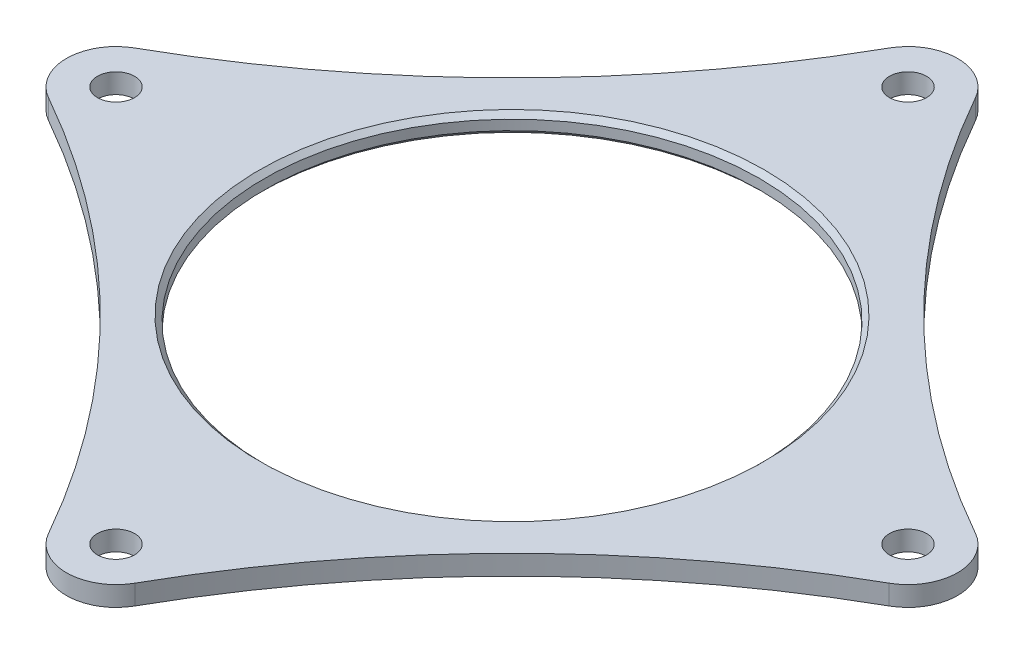
ISO-10303-21;
HEADER;
FILE_DESCRIPTION(('STEP AP214'),'2;1');
FILE_NAME('part.step','',(''),(''),'','','');
FILE_SCHEMA(('AUTOMOTIVE_DESIGN { 1 0 10303 214 1 1 1 1 }'));
ENDSEC;
DATA;
#1=APPLICATION_CONTEXT('core data for automotive mechanical design processes');
#2=APPLICATION_PROTOCOL_DEFINITION('international standard','automotive_design',2000,#1);
#3=PRODUCT_CONTEXT('',#1,'mechanical');
#4=PRODUCT('Part','Part','',(#3));
#5=PRODUCT_RELATED_PRODUCT_CATEGORY('part','',(#4));
#6=PRODUCT_DEFINITION_FORMATION('','',#4);
#7=PRODUCT_DEFINITION_CONTEXT('part definition',#1,'design');
#8=PRODUCT_DEFINITION('design','',#6,#7);
#9=PRODUCT_DEFINITION_SHAPE('','',#8);
#10=(LENGTH_UNIT() NAMED_UNIT(*) SI_UNIT(.MILLI.,.METRE.));
#11=(NAMED_UNIT(*) PLANE_ANGLE_UNIT() SI_UNIT($,.RADIAN.));
#12=(NAMED_UNIT(*) SI_UNIT($,.STERADIAN.) SOLID_ANGLE_UNIT());
#13=UNCERTAINTY_MEASURE_WITH_UNIT(LENGTH_MEASURE(1.E-05),#10,'distance_accuracy_value','');
#14=(GEOMETRIC_REPRESENTATION_CONTEXT(3) GLOBAL_UNCERTAINTY_ASSIGNED_CONTEXT((#13)) GLOBAL_UNIT_ASSIGNED_CONTEXT((#10,
#11,#12)) REPRESENTATION_CONTEXT('',''));
#15=CARTESIAN_POINT('',(0.,0.,0.));
#16=DIRECTION('',(0.,0.,1.));
#17=DIRECTION('',(1.,0.,0.));
#18=AXIS2_PLACEMENT_3D('',#15,#16,#17);
#19=CARTESIAN_POINT('',(0.,5.08,0.));
#20=DIRECTION('',(0.,-1.,0.));
#21=DIRECTION('',(0.,0.,-1.));
#22=AXIS2_PLACEMENT_3D('',#19,#20,#21);
#23=PLANE('',#22);
#24=CARTESIAN_POINT('',(0.,5.08,0.));
#25=DIRECTION('',(0.,-1.,0.));
#26=DIRECTION('',(0.,0.,-1.));
#27=AXIS2_PLACEMENT_3D('',#24,#25,#26);
#28=CIRCLE('',#27,64.77);
#29=CARTESIAN_POINT('',(0.,5.08,-64.77));
#30=VERTEX_POINT('',#29);
#31=EDGE_CURVE('E11',#30,#30,#28,.T.);
#32=ORIENTED_EDGE('',*,*,#31,.T.);
#33=EDGE_LOOP('',(#32));
#34=FACE_BOUND('',#33,.T.);
#35=CARTESIAN_POINT('',(0.,5.08,101.6));
#36=DIRECTION('',(0.,-1.,0.));
#37=DIRECTION('',(0.,0.,-1.));
#38=AXIS2_PLACEMENT_3D('',#35,#36,#37);
#39=CIRCLE('',#38,12.7);
#40=CARTESIAN_POINT('',(11.0673543097703,5.08,107.829259071674));
#41=VERTEX_POINT('',#40);
#42=CARTESIAN_POINT('',(-11.0673543097692,5.08,107.829259071674));
#43=VERTEX_POINT('',#42);
#44=EDGE_CURVE('E113',#41,#43,#39,.T.);
#45=ORIENTED_EDGE('',*,*,#44,.F.);
#46=CARTESIAN_POINT('',(232.414440505156,5.08,232.414440505151));
#47=DIRECTION('',(0.,1.,0.));
#48=DIRECTION('',(-1.,0.,0.));
#49=AXIS2_PLACEMENT_3D('',#46,#47,#48);
#50=CIRCLE('',#49,254.);
#51=CARTESIAN_POINT('',(107.829259071674,5.08,11.0673543097681));
#52=VERTEX_POINT('',#51);
#53=EDGE_CURVE('E201',#52,#41,#50,.T.);
#54=ORIENTED_EDGE('',*,*,#53,.F.);
#55=CARTESIAN_POINT('',(101.6,5.08,0.));
#56=DIRECTION('',(0.,-1.,0.));
#57=DIRECTION('',(0.,0.,1.));
#58=AXIS2_PLACEMENT_3D('',#55,#56,#57);
#59=CIRCLE('',#58,12.7);
#60=CARTESIAN_POINT('',(107.829259071674,5.08,-11.0673543097692));
#61=VERTEX_POINT('',#60);
#62=EDGE_CURVE('E148',#61,#52,#59,.T.);
#63=ORIENTED_EDGE('',*,*,#62,.F.);
#64=CARTESIAN_POINT('',(232.414440505154,5.08,-232.414440505154));
#65=DIRECTION('',(0.,1.,0.));
#66=DIRECTION('',(0.,0.,1.));
#67=AXIS2_PLACEMENT_3D('',#64,#65,#66);
#68=CIRCLE('',#67,254.);
#69=CARTESIAN_POINT('',(11.0673543097692,5.08,-107.829259071674));
#70=VERTEX_POINT('',#69);
#71=EDGE_CURVE('E152',#70,#61,#68,.T.);
#72=ORIENTED_EDGE('',*,*,#71,.F.);
#73=CARTESIAN_POINT('',(0.,5.08,-101.6));
#74=DIRECTION('',(0.,-1.,0.));
#75=DIRECTION('',(0.,0.,1.));
#76=AXIS2_PLACEMENT_3D('',#73,#74,#75);
#77=CIRCLE('',#76,12.7);
#78=CARTESIAN_POINT('',(-11.0673543097696,5.08,-107.829259071674));
#79=VERTEX_POINT('',#78);
#80=EDGE_CURVE('E157',#79,#70,#77,.T.);
#81=ORIENTED_EDGE('',*,*,#80,.F.);
#82=CARTESIAN_POINT('',(-232.414440505154,5.08,-232.414440505153));
#83=DIRECTION('',(0.,1.,0.));
#84=DIRECTION('',(1.,0.,0.));
#85=AXIS2_PLACEMENT_3D('',#82,#83,#84);
#86=CIRCLE('',#85,254.);
#87=CARTESIAN_POINT('',(-107.829259071674,5.08,-11.0673543097688));
#88=VERTEX_POINT('',#87);
#89=EDGE_CURVE('E139',#88,#79,#86,.T.);
#90=ORIENTED_EDGE('',*,*,#89,.F.);
#91=CARTESIAN_POINT('',(-101.6,5.08,3.55777139112361E-13));
#92=DIRECTION('',(0.,-1.,0.));
#93=DIRECTION('',(1.,0.,0.));
#94=AXIS2_PLACEMENT_3D('',#91,#92,#93);
#95=CIRCLE('',#94,12.7);
#96=CARTESIAN_POINT('',(-107.829259071674,5.08,11.0673543097692));
#97=VERTEX_POINT('',#96);
#98=EDGE_CURVE('E142',#97,#88,#95,.T.);
#99=ORIENTED_EDGE('',*,*,#98,.F.);
#100=CARTESIAN_POINT('',(-232.414440505154,5.08,232.414440505154));
#101=DIRECTION('',(0.,1.,0.));
#102=DIRECTION('',(0.,0.,-1.));
#103=AXIS2_PLACEMENT_3D('',#100,#101,#102);
#104=CIRCLE('',#103,254.);
#105=EDGE_CURVE('E144',#43,#97,#104,.T.);
#106=ORIENTED_EDGE('',*,*,#105,.F.);
#107=EDGE_LOOP('',(#45,#54,#63,#72,#81,#90,#99,#106));
#108=FACE_BOUND('',#107,.T.);
#109=CARTESIAN_POINT('',(101.6,5.08,0.));
#110=DIRECTION('',(0.,1.,0.));
#111=DIRECTION('',(0.,0.,1.));
#112=AXIS2_PLACEMENT_3D('',#109,#110,#111);
#113=CIRCLE('',#112,4.76249999999999);
#114=CARTESIAN_POINT('',(101.6,5.08,4.76249999999999));
#115=VERTEX_POINT('',#114);
#116=EDGE_CURVE('E202',#115,#115,#113,.T.);
#117=ORIENTED_EDGE('',*,*,#116,.F.);
#118=EDGE_LOOP('',(#117));
#119=FACE_BOUND('',#118,.T.);
#120=CARTESIAN_POINT('',(-3.54734504026462E-13,5.08,-101.6));
#121=DIRECTION('',(0.,1.,0.));
#122=DIRECTION('',(0.,0.,1.));
#123=AXIS2_PLACEMENT_3D('',#120,#121,#122);
#124=CIRCLE('',#123,4.76249999999999);
#125=CARTESIAN_POINT('',(-3.54734504026462E-13,5.08,-96.8375));
#126=VERTEX_POINT('',#125);
#127=EDGE_CURVE('E395',#126,#126,#124,.T.);
#128=ORIENTED_EDGE('',*,*,#127,.F.);
#129=EDGE_LOOP('',(#128));
#130=FACE_BOUND('',#129,.T.);
#131=CARTESIAN_POINT('',(-101.6,5.08,0.));
#132=DIRECTION('',(0.,1.,0.));
#133=DIRECTION('',(0.,0.,1.));
#134=AXIS2_PLACEMENT_3D('',#131,#132,#133);
#135=CIRCLE('',#134,4.76249999999999);
#136=CARTESIAN_POINT('',(-101.6,5.08,4.76249999999999));
#137=VERTEX_POINT('',#136);
#138=EDGE_CURVE('E388',#137,#137,#135,.T.);
#139=ORIENTED_EDGE('',*,*,#138,.F.);
#140=EDGE_LOOP('',(#139));
#141=FACE_BOUND('',#140,.T.);
#142=CARTESIAN_POINT('',(1.06420351207939E-12,5.08,101.6));
#143=DIRECTION('',(0.,1.,0.));
#144=DIRECTION('',(0.,0.,1.));
#145=AXIS2_PLACEMENT_3D('',#142,#143,#144);
#146=CIRCLE('',#145,4.76249999999999);
#147=CARTESIAN_POINT('',(1.06420351207939E-12,5.08,106.3625));
#148=VERTEX_POINT('',#147);
#149=EDGE_CURVE('E387',#148,#148,#146,.T.);
#150=ORIENTED_EDGE('',*,*,#149,.F.);
#151=EDGE_LOOP('',(#150));
#152=FACE_BOUND('',#151,.T.);
#153=ADVANCED_FACE('F37',(#34,#108,#119,#130,#141,#152),#23,.F.);
#154=CARTESIAN_POINT('',(0.,0.,0.));
#155=DIRECTION('',(0.,-1.,0.));
#156=DIRECTION('',(0.,0.,-1.));
#157=AXIS2_PLACEMENT_3D('',#154,#155,#156);
#158=PLANE('',#157);
#159=CARTESIAN_POINT('',(0.,0.,0.));
#160=DIRECTION('',(0.,-1.,0.));
#161=DIRECTION('',(0.,0.,-1.));
#162=AXIS2_PLACEMENT_3D('',#159,#160,#161);
#163=CIRCLE('',#162,64.77);
#164=CARTESIAN_POINT('',(0.,0.,-64.77));
#165=VERTEX_POINT('',#164);
#166=EDGE_CURVE('E161',#165,#165,#163,.F.);
#167=ORIENTED_EDGE('',*,*,#166,.T.);
#168=EDGE_LOOP('',(#167));
#169=FACE_BOUND('',#168,.T.);
#170=CARTESIAN_POINT('',(1.06420351207939E-12,0.,101.6));
#171=DIRECTION('',(0.,-1.,0.));
#172=DIRECTION('',(0.,0.,-1.));
#173=AXIS2_PLACEMENT_3D('',#170,#171,#172);
#174=CIRCLE('',#173,4.76249999999999);
#175=CARTESIAN_POINT('',(1.06420351207939E-12,0.,96.8375));
#176=VERTEX_POINT('',#175);
#177=EDGE_CURVE('E188',#176,#176,#174,.T.);
#178=ORIENTED_EDGE('',*,*,#177,.F.);
#179=EDGE_LOOP('',(#178));
#180=FACE_BOUND('',#179,.T.);
#181=CARTESIAN_POINT('',(-101.6,0.,0.));
#182=DIRECTION('',(0.,-1.,0.));
#183=DIRECTION('',(0.,0.,-1.));
#184=AXIS2_PLACEMENT_3D('',#181,#182,#183);
#185=CIRCLE('',#184,4.7625);
#186=CARTESIAN_POINT('',(-101.6,0.,-4.7625));
#187=VERTEX_POINT('',#186);
#188=EDGE_CURVE('E192',#187,#187,#185,.T.);
#189=ORIENTED_EDGE('',*,*,#188,.F.);
#190=EDGE_LOOP('',(#189));
#191=FACE_BOUND('',#190,.T.);
#192=CARTESIAN_POINT('',(-3.54734504026462E-13,0.,-101.6));
#193=DIRECTION('',(0.,-1.,0.));
#194=DIRECTION('',(0.,0.,-1.));
#195=AXIS2_PLACEMENT_3D('',#192,#193,#194);
#196=CIRCLE('',#195,4.76249999999999);
#197=CARTESIAN_POINT('',(-3.54734504026462E-13,0.,-106.3625));
#198=VERTEX_POINT('',#197);
#199=EDGE_CURVE('E196',#198,#198,#196,.T.);
#200=ORIENTED_EDGE('',*,*,#199,.F.);
#201=EDGE_LOOP('',(#200));
#202=FACE_BOUND('',#201,.T.);
#203=CARTESIAN_POINT('',(101.6,0.,0.));
#204=DIRECTION('',(0.,-1.,0.));
#205=DIRECTION('',(0.,0.,-1.));
#206=AXIS2_PLACEMENT_3D('',#203,#204,#205);
#207=CIRCLE('',#206,4.7625);
#208=CARTESIAN_POINT('',(101.6,0.,-4.7625));
#209=VERTEX_POINT('',#208);
#210=EDGE_CURVE('E199',#209,#209,#207,.T.);
#211=ORIENTED_EDGE('',*,*,#210,.F.);
#212=EDGE_LOOP('',(#211));
#213=FACE_BOUND('',#212,.T.);
#214=CARTESIAN_POINT('',(232.414440505156,0.,232.414440505151));
#215=DIRECTION('',(0.,1.,0.));
#216=DIRECTION('',(-1.,0.,0.));
#217=AXIS2_PLACEMENT_3D('',#214,#215,#216);
#218=CIRCLE('',#217,254.);
#219=CARTESIAN_POINT('',(107.829259071674,0.,11.0673543097681));
#220=VERTEX_POINT('',#219);
#221=CARTESIAN_POINT('',(11.0673543097703,0.,107.829259071674));
#222=VERTEX_POINT('',#221);
#223=EDGE_CURVE('E131',#220,#222,#218,.T.);
#224=ORIENTED_EDGE('',*,*,#223,.T.);
#225=CARTESIAN_POINT('',(0.,0.,101.6));
#226=DIRECTION('',(0.,-1.,0.));
#227=DIRECTION('',(0.,0.,-1.));
#228=AXIS2_PLACEMENT_3D('',#225,#226,#227);
#229=CIRCLE('',#228,12.7);
#230=CARTESIAN_POINT('',(-11.0673543097692,0.,107.829259071674));
#231=VERTEX_POINT('',#230);
#232=EDGE_CURVE('E110',#222,#231,#229,.T.);
#233=ORIENTED_EDGE('',*,*,#232,.T.);
#234=CARTESIAN_POINT('',(-232.414440505154,0.,232.414440505154));
#235=DIRECTION('',(0.,1.,0.));
#236=DIRECTION('',(0.,0.,-1.));
#237=AXIS2_PLACEMENT_3D('',#234,#235,#236);
#238=CIRCLE('',#237,254.);
#239=CARTESIAN_POINT('',(-107.829259071674,0.,11.0673543097692));
#240=VERTEX_POINT('',#239);
#241=EDGE_CURVE('E118',#231,#240,#238,.T.);
#242=ORIENTED_EDGE('',*,*,#241,.T.);
#243=CARTESIAN_POINT('',(-101.6,0.,3.55777139112361E-13));
#244=DIRECTION('',(0.,-1.,0.));
#245=DIRECTION('',(1.,0.,0.));
#246=AXIS2_PLACEMENT_3D('',#243,#244,#245);
#247=CIRCLE('',#246,12.7);
#248=CARTESIAN_POINT('',(-107.829259071674,0.,-11.0673543097688));
#249=VERTEX_POINT('',#248);
#250=EDGE_CURVE('E136',#240,#249,#247,.T.);
#251=ORIENTED_EDGE('',*,*,#250,.T.);
#252=CARTESIAN_POINT('',(-232.414440505154,0.,-232.414440505153));
#253=DIRECTION('',(0.,1.,0.));
#254=DIRECTION('',(1.,0.,0.));
#255=AXIS2_PLACEMENT_3D('',#252,#253,#254);
#256=CIRCLE('',#255,254.);
#257=CARTESIAN_POINT('',(-11.0673543097696,0.,-107.829259071674));
#258=VERTEX_POINT('',#257);
#259=EDGE_CURVE('E138',#249,#258,#256,.T.);
#260=ORIENTED_EDGE('',*,*,#259,.T.);
#261=CARTESIAN_POINT('',(0.,0.,-101.6));
#262=DIRECTION('',(0.,-1.,0.));
#263=DIRECTION('',(0.,0.,1.));
#264=AXIS2_PLACEMENT_3D('',#261,#262,#263);
#265=CIRCLE('',#264,12.7);
#266=CARTESIAN_POINT('',(11.0673543097692,0.,-107.829259071674));
#267=VERTEX_POINT('',#266);
#268=EDGE_CURVE('E74',#258,#267,#265,.T.);
#269=ORIENTED_EDGE('',*,*,#268,.T.);
#270=CARTESIAN_POINT('',(232.414440505154,0.,-232.414440505154));
#271=DIRECTION('',(0.,1.,0.));
#272=DIRECTION('',(0.,0.,1.));
#273=AXIS2_PLACEMENT_3D('',#270,#271,#272);
#274=CIRCLE('',#273,254.);
#275=CARTESIAN_POINT('',(107.829259071674,0.,-11.0673543097692));
#276=VERTEX_POINT('',#275);
#277=EDGE_CURVE('E52',#267,#276,#274,.T.);
#278=ORIENTED_EDGE('',*,*,#277,.T.);
#279=CARTESIAN_POINT('',(101.6,0.,0.));
#280=DIRECTION('',(0.,-1.,0.));
#281=DIRECTION('',(0.,0.,1.));
#282=AXIS2_PLACEMENT_3D('',#279,#280,#281);
#283=CIRCLE('',#282,12.7);
#284=EDGE_CURVE('E150',#276,#220,#283,.T.);
#285=ORIENTED_EDGE('',*,*,#284,.T.);
#286=EDGE_LOOP('',(#224,#233,#242,#251,#260,#269,#278,#285));
#287=FACE_BOUND('',#286,.T.);
#288=ADVANCED_FACE('F128',(#169,#180,#191,#202,#213,#287),#158,.T.);
#289=CARTESIAN_POINT('',(0.,0.,0.));
#290=DIRECTION('',(0.,1.,0.));
#291=DIRECTION('',(0.,0.,1.));
#292=AXIS2_PLACEMENT_3D('',#289,#290,#291);
#293=CYLINDRICAL_SURFACE('',#292,63.5);
#294=CARTESIAN_POINT('',(0.,1.27000000000002,0.));
#295=DIRECTION('',(0.,-1.,0.));
#296=DIRECTION('',(0.,0.,-1.));
#297=AXIS2_PLACEMENT_3D('',#294,#295,#296);
#298=CIRCLE('',#297,63.5);
#299=CARTESIAN_POINT('',(0.,1.27000000000002,-63.5));
#300=VERTEX_POINT('',#299);
#301=EDGE_CURVE('E45',#300,#300,#298,.T.);
#302=ORIENTED_EDGE('',*,*,#301,.T.);
#303=EDGE_LOOP('',(#302));
#304=FACE_BOUND('',#303,.T.);
#305=CARTESIAN_POINT('',(0.,3.81000000000003,0.));
#306=DIRECTION('',(0.,-1.,0.));
#307=DIRECTION('',(0.,0.,-1.));
#308=AXIS2_PLACEMENT_3D('',#305,#306,#307);
#309=CIRCLE('',#308,63.5);
#310=CARTESIAN_POINT('',(0.,3.81000000000003,-63.5));
#311=VERTEX_POINT('',#310);
#312=EDGE_CURVE('E166',#311,#311,#309,.F.);
#313=ORIENTED_EDGE('',*,*,#312,.T.);
#314=EDGE_LOOP('',(#313));
#315=FACE_BOUND('',#314,.T.);
#316=ADVANCED_FACE('F173',(#304,#315),#293,.F.);
#317=CARTESIAN_POINT('',(101.6,0.,0.));
#318=DIRECTION('',(0.,1.,0.));
#319=DIRECTION('',(0.,0.,1.));
#320=AXIS2_PLACEMENT_3D('',#317,#318,#319);
#321=CYLINDRICAL_SURFACE('',#320,12.7);
#322=ORIENTED_EDGE('',*,*,#62,.T.);
#323=DIRECTION('',(0.,1.,0.));
#324=VECTOR('',#323,1.);
#325=CARTESIAN_POINT('',(107.829259071674,0.,11.0673543097681));
#326=LINE('',#325,#324);
#327=EDGE_CURVE('E210',#220,#52,#326,.T.);
#328=ORIENTED_EDGE('',*,*,#327,.F.);
#329=ORIENTED_EDGE('',*,*,#284,.F.);
#330=DIRECTION('',(0.,1.,0.));
#331=VECTOR('',#330,1.);
#332=CARTESIAN_POINT('',(107.829259071674,0.,-11.0673543097692));
#333=LINE('',#332,#331);
#334=EDGE_CURVE('E58',#276,#61,#333,.T.);
#335=ORIENTED_EDGE('',*,*,#334,.T.);
#336=EDGE_LOOP('',(#322,#328,#329,#335));
#337=FACE_BOUND('',#336,.T.);
#338=ADVANCED_FACE('F229',(#337),#321,.T.);
#339=CARTESIAN_POINT('',(232.414440505154,0.,-232.414440505154));
#340=DIRECTION('',(0.,1.,0.));
#341=DIRECTION('',(0.,0.,1.));
#342=AXIS2_PLACEMENT_3D('',#339,#340,#341);
#343=CYLINDRICAL_SURFACE('',#342,254.);
#344=ORIENTED_EDGE('',*,*,#71,.T.);
#345=ORIENTED_EDGE('',*,*,#334,.F.);
#346=ORIENTED_EDGE('',*,*,#277,.F.);
#347=DIRECTION('',(0.,1.,0.));
#348=VECTOR('',#347,1.);
#349=CARTESIAN_POINT('',(11.0673543097692,0.,-107.829259071674));
#350=LINE('',#349,#348);
#351=EDGE_CURVE('E66',#267,#70,#350,.T.);
#352=ORIENTED_EDGE('',*,*,#351,.T.);
#353=EDGE_LOOP('',(#344,#345,#346,#352));
#354=FACE_BOUND('',#353,.T.);
#355=ADVANCED_FACE('F227',(#354),#343,.F.);
#356=CARTESIAN_POINT('',(0.,0.,-101.6));
#357=DIRECTION('',(0.,1.,0.));
#358=DIRECTION('',(0.,0.,1.));
#359=AXIS2_PLACEMENT_3D('',#356,#357,#358);
#360=CYLINDRICAL_SURFACE('',#359,12.7);
#361=ORIENTED_EDGE('',*,*,#80,.T.);
#362=ORIENTED_EDGE('',*,*,#351,.F.);
#363=ORIENTED_EDGE('',*,*,#268,.F.);
#364=DIRECTION('',(0.,1.,0.));
#365=VECTOR('',#364,1.);
#366=CARTESIAN_POINT('',(-11.0673543097696,0.,-107.829259071674));
#367=LINE('',#366,#365);
#368=EDGE_CURVE('E146',#258,#79,#367,.T.);
#369=ORIENTED_EDGE('',*,*,#368,.T.);
#370=EDGE_LOOP('',(#361,#362,#363,#369));
#371=FACE_BOUND('',#370,.T.);
#372=ADVANCED_FACE('F224',(#371),#360,.T.);
#373=CARTESIAN_POINT('',(-232.414440505154,0.,-232.414440505153));
#374=DIRECTION('',(0.,1.,0.));
#375=DIRECTION('',(0.,0.,1.));
#376=AXIS2_PLACEMENT_3D('',#373,#374,#375);
#377=CYLINDRICAL_SURFACE('',#376,254.);
#378=ORIENTED_EDGE('',*,*,#89,.T.);
#379=ORIENTED_EDGE('',*,*,#368,.F.);
#380=ORIENTED_EDGE('',*,*,#259,.F.);
#381=DIRECTION('',(0.,1.,0.));
#382=VECTOR('',#381,1.);
#383=CARTESIAN_POINT('',(-107.829259071674,0.,-11.0673543097688));
#384=LINE('',#383,#382);
#385=EDGE_CURVE('E85',#249,#88,#384,.T.);
#386=ORIENTED_EDGE('',*,*,#385,.T.);
#387=EDGE_LOOP('',(#378,#379,#380,#386));
#388=FACE_BOUND('',#387,.T.);
#389=ADVANCED_FACE('F223',(#388),#377,.F.);
#390=CARTESIAN_POINT('',(-101.6,0.,3.55777139112361E-13));
#391=DIRECTION('',(0.,1.,0.));
#392=DIRECTION('',(0.,0.,1.));
#393=AXIS2_PLACEMENT_3D('',#390,#391,#392);
#394=CYLINDRICAL_SURFACE('',#393,12.7);
#395=ORIENTED_EDGE('',*,*,#98,.T.);
#396=ORIENTED_EDGE('',*,*,#385,.F.);
#397=ORIENTED_EDGE('',*,*,#250,.F.);
#398=DIRECTION('',(0.,1.,0.));
#399=VECTOR('',#398,1.);
#400=CARTESIAN_POINT('',(-107.829259071674,0.,11.0673543097692));
#401=LINE('',#400,#399);
#402=EDGE_CURVE('E121',#240,#97,#401,.T.);
#403=ORIENTED_EDGE('',*,*,#402,.T.);
#404=EDGE_LOOP('',(#395,#396,#397,#403));
#405=FACE_BOUND('',#404,.T.);
#406=ADVANCED_FACE('F222',(#405),#394,.T.);
#407=CARTESIAN_POINT('',(-232.414440505154,0.,232.414440505154));
#408=DIRECTION('',(0.,1.,0.));
#409=DIRECTION('',(0.,0.,1.));
#410=AXIS2_PLACEMENT_3D('',#407,#408,#409);
#411=CYLINDRICAL_SURFACE('',#410,254.);
#412=ORIENTED_EDGE('',*,*,#105,.T.);
#413=ORIENTED_EDGE('',*,*,#402,.F.);
#414=ORIENTED_EDGE('',*,*,#241,.F.);
#415=DIRECTION('',(0.,1.,0.));
#416=VECTOR('',#415,1.);
#417=CARTESIAN_POINT('',(-11.0673543097692,0.,107.829259071674));
#418=LINE('',#417,#416);
#419=EDGE_CURVE('E95',#231,#43,#418,.T.);
#420=ORIENTED_EDGE('',*,*,#419,.T.);
#421=EDGE_LOOP('',(#412,#413,#414,#420));
#422=FACE_BOUND('',#421,.T.);
#423=ADVANCED_FACE('F119',(#422),#411,.F.);
#424=CARTESIAN_POINT('',(0.,0.,101.6));
#425=DIRECTION('',(0.,1.,0.));
#426=DIRECTION('',(0.,0.,1.));
#427=AXIS2_PLACEMENT_3D('',#424,#425,#426);
#428=CYLINDRICAL_SURFACE('',#427,12.7);
#429=ORIENTED_EDGE('',*,*,#44,.T.);
#430=ORIENTED_EDGE('',*,*,#419,.F.);
#431=ORIENTED_EDGE('',*,*,#232,.F.);
#432=DIRECTION('',(0.,1.,0.));
#433=VECTOR('',#432,1.);
#434=CARTESIAN_POINT('',(11.0673543097703,0.,107.829259071674));
#435=LINE('',#434,#433);
#436=EDGE_CURVE('E125',#222,#41,#435,.T.);
#437=ORIENTED_EDGE('',*,*,#436,.T.);
#438=EDGE_LOOP('',(#429,#430,#431,#437));
#439=FACE_BOUND('',#438,.T.);
#440=ADVANCED_FACE('F107',(#439),#428,.T.);
#441=CARTESIAN_POINT('',(232.414440505156,0.,232.414440505151));
#442=DIRECTION('',(0.,1.,0.));
#443=DIRECTION('',(0.,0.,1.));
#444=AXIS2_PLACEMENT_3D('',#441,#442,#443);
#445=CYLINDRICAL_SURFACE('',#444,254.);
#446=ORIENTED_EDGE('',*,*,#53,.T.);
#447=ORIENTED_EDGE('',*,*,#436,.F.);
#448=ORIENTED_EDGE('',*,*,#223,.F.);
#449=ORIENTED_EDGE('',*,*,#327,.T.);
#450=EDGE_LOOP('',(#446,#447,#448,#449));
#451=FACE_BOUND('',#450,.T.);
#452=ADVANCED_FACE('F300',(#451),#445,.F.);
#453=CARTESIAN_POINT('',(101.6,5.08,0.));
#454=DIRECTION('',(0.,1.,0.));
#455=DIRECTION('',(0.,0.,1.));
#456=AXIS2_PLACEMENT_3D('',#453,#454,#455);
#457=CYLINDRICAL_SURFACE('',#456,4.7625);
#458=ORIENTED_EDGE('',*,*,#116,.T.);
#459=EDGE_LOOP('',(#458));
#460=FACE_BOUND('',#459,.T.);
#461=ORIENTED_EDGE('',*,*,#210,.T.);
#462=EDGE_LOOP('',(#461));
#463=FACE_BOUND('',#462,.T.);
#464=ADVANCED_FACE('F309',(#460,#463),#457,.F.);
#465=CARTESIAN_POINT('',(-3.54734504026462E-13,5.08,-101.6));
#466=DIRECTION('',(0.,1.,0.));
#467=DIRECTION('',(0.,0.,1.));
#468=AXIS2_PLACEMENT_3D('',#465,#466,#467);
#469=CYLINDRICAL_SURFACE('',#468,4.76249999999999);
#470=ORIENTED_EDGE('',*,*,#127,.T.);
#471=EDGE_LOOP('',(#470));
#472=FACE_BOUND('',#471,.T.);
#473=ORIENTED_EDGE('',*,*,#199,.T.);
#474=EDGE_LOOP('',(#473));
#475=FACE_BOUND('',#474,.T.);
#476=ADVANCED_FACE('F319',(#472,#475),#469,.F.);
#477=CARTESIAN_POINT('',(-101.6,5.08,0.));
#478=DIRECTION('',(0.,1.,0.));
#479=DIRECTION('',(0.,0.,1.));
#480=AXIS2_PLACEMENT_3D('',#477,#478,#479);
#481=CYLINDRICAL_SURFACE('',#480,4.7625);
#482=ORIENTED_EDGE('',*,*,#138,.T.);
#483=EDGE_LOOP('',(#482));
#484=FACE_BOUND('',#483,.T.);
#485=ORIENTED_EDGE('',*,*,#188,.T.);
#486=EDGE_LOOP('',(#485));
#487=FACE_BOUND('',#486,.T.);
#488=ADVANCED_FACE('F330',(#484,#487),#481,.F.);
#489=CARTESIAN_POINT('',(1.06420351207939E-12,5.08,101.6));
#490=DIRECTION('',(0.,1.,0.));
#491=DIRECTION('',(0.,0.,1.));
#492=AXIS2_PLACEMENT_3D('',#489,#490,#491);
#493=CYLINDRICAL_SURFACE('',#492,4.76249999999999);
#494=ORIENTED_EDGE('',*,*,#149,.T.);
#495=EDGE_LOOP('',(#494));
#496=FACE_BOUND('',#495,.T.);
#497=ORIENTED_EDGE('',*,*,#177,.T.);
#498=EDGE_LOOP('',(#497));
#499=FACE_BOUND('',#498,.T.);
#500=ADVANCED_FACE('F179',(#496,#499),#493,.F.);
#501=CARTESIAN_POINT('',(0.,0.,0.));
#502=DIRECTION('',(0.,-1.,0.));
#503=DIRECTION('',(0.,0.,-1.));
#504=AXIS2_PLACEMENT_3D('',#501,#502,#503);
#505=CONICAL_SURFACE('',#504,64.77,0.785398163397448);
#506=ORIENTED_EDGE('',*,*,#301,.F.);
#507=EDGE_LOOP('',(#506));
#508=FACE_BOUND('',#507,.T.);
#509=ORIENTED_EDGE('',*,*,#166,.F.);
#510=EDGE_LOOP('',(#509));
#511=FACE_BOUND('',#510,.T.);
#512=ADVANCED_FACE('F176',(#508,#511),#505,.F.);
#513=CARTESIAN_POINT('',(0.,3.81000000000003,0.));
#514=DIRECTION('',(0.,1.,0.));
#515=DIRECTION('',(0.,0.,1.));
#516=AXIS2_PLACEMENT_3D('',#513,#514,#515);
#517=CONICAL_SURFACE('',#516,63.5,0.785398163397448);
#518=ORIENTED_EDGE('',*,*,#31,.F.);
#519=EDGE_LOOP('',(#518));
#520=FACE_BOUND('',#519,.T.);
#521=ORIENTED_EDGE('',*,*,#312,.F.);
#522=EDGE_LOOP('',(#521));
#523=FACE_BOUND('',#522,.T.);
#524=ADVANCED_FACE('F39',(#520,#523),#517,.F.);
#525=CLOSED_SHELL('',(#153,#288,#316,#338,#355,#372,#389,#406,#423,#440,#452,#464,#476,#488,
#500,#512,#524));
#526=MANIFOLD_SOLID_BREP('B2',#525);
#527=ADVANCED_BREP_SHAPE_REPRESENTATION('',(#18,#526),#14);
#528=SHAPE_DEFINITION_REPRESENTATION(#9,#527);
ENDSEC;
END-ISO-10303-21;
